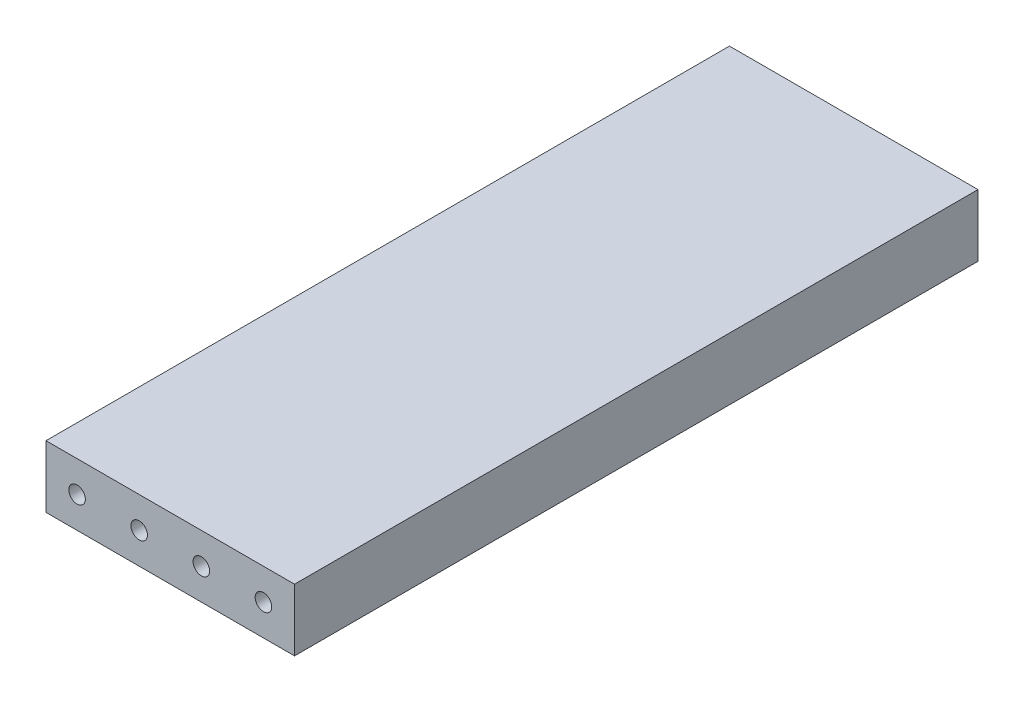
ISO-10303-21;
HEADER;
FILE_DESCRIPTION(('STEP AP214'),'2;1');
FILE_NAME('part.step','',(''),(''),'','','');
FILE_SCHEMA(('AUTOMOTIVE_DESIGN { 1 0 10303 214 1 1 1 1 }'));
ENDSEC;
DATA;
#1=APPLICATION_CONTEXT('core data for automotive mechanical design processes');
#2=APPLICATION_PROTOCOL_DEFINITION('international standard','automotive_design',2000,#1);
#3=PRODUCT_CONTEXT('',#1,'mechanical');
#4=PRODUCT('Part','Part','',(#3));
#5=PRODUCT_RELATED_PRODUCT_CATEGORY('part','',(#4));
#6=PRODUCT_DEFINITION_FORMATION('','',#4);
#7=PRODUCT_DEFINITION_CONTEXT('part definition',#1,'design');
#8=PRODUCT_DEFINITION('design','',#6,#7);
#9=PRODUCT_DEFINITION_SHAPE('','',#8);
#10=(LENGTH_UNIT() NAMED_UNIT(*) SI_UNIT(.MILLI.,.METRE.));
#11=(NAMED_UNIT(*) PLANE_ANGLE_UNIT() SI_UNIT($,.RADIAN.));
#12=(NAMED_UNIT(*) SI_UNIT($,.STERADIAN.) SOLID_ANGLE_UNIT());
#13=UNCERTAINTY_MEASURE_WITH_UNIT(LENGTH_MEASURE(1.E-05),#10,'distance_accuracy_value','');
#14=(GEOMETRIC_REPRESENTATION_CONTEXT(3) GLOBAL_UNCERTAINTY_ASSIGNED_CONTEXT((#13)) GLOBAL_UNIT_ASSIGNED_CONTEXT((#10,
#11,#12)) REPRESENTATION_CONTEXT('',''));
#15=CARTESIAN_POINT('',(0.,0.,0.));
#16=DIRECTION('',(0.,0.,1.));
#17=DIRECTION('',(1.,0.,0.));
#18=AXIS2_PLACEMENT_3D('',#15,#16,#17);
#19=CARTESIAN_POINT('',(60.,-15.,165.));
#20=DIRECTION('',(-1.,0.,0.));
#21=DIRECTION('',(0.,0.,1.));
#22=AXIS2_PLACEMENT_3D('',#19,#20,#21);
#23=PLANE('',#22);
#24=DIRECTION('',(0.,1.,0.));
#25=VECTOR('',#24,1.);
#26=CARTESIAN_POINT('',(60.,-15.,-165.));
#27=LINE('',#26,#25);
#28=CARTESIAN_POINT('',(60.,-15.,-165.));
#29=VERTEX_POINT('',#28);
#30=CARTESIAN_POINT('',(60.,15.,-165.));
#31=VERTEX_POINT('',#30);
#32=EDGE_CURVE('E98',#29,#31,#27,.T.);
#33=ORIENTED_EDGE('',*,*,#32,.T.);
#34=DIRECTION('',(0.,0.,-1.));
#35=VECTOR('',#34,1.);
#36=CARTESIAN_POINT('',(60.,15.,165.));
#37=LINE('',#36,#35);
#38=CARTESIAN_POINT('',(60.,15.,165.));
#39=VERTEX_POINT('',#38);
#40=EDGE_CURVE('E11',#39,#31,#37,.T.);
#41=ORIENTED_EDGE('',*,*,#40,.F.);
#42=DIRECTION('',(0.,1.,0.));
#43=VECTOR('',#42,1.);
#44=CARTESIAN_POINT('',(60.,-15.,165.));
#45=LINE('',#44,#43);
#46=CARTESIAN_POINT('',(60.,-15.,165.));
#47=VERTEX_POINT('',#46);
#48=EDGE_CURVE('E86',#47,#39,#45,.T.);
#49=ORIENTED_EDGE('',*,*,#48,.F.);
#50=DIRECTION('',(0.,0.,-1.));
#51=VECTOR('',#50,1.);
#52=CARTESIAN_POINT('',(60.,-15.,165.));
#53=LINE('',#52,#51);
#54=EDGE_CURVE('E94',#47,#29,#53,.T.);
#55=ORIENTED_EDGE('',*,*,#54,.T.);
#56=EDGE_LOOP('',(#33,#41,#49,#55));
#57=FACE_BOUND('',#56,.T.);
#58=ADVANCED_FACE('F35',(#57),#23,.F.);
#59=CARTESIAN_POINT('',(-60.,15.,165.));
#60=DIRECTION('',(0.,-1.,0.));
#61=DIRECTION('',(0.,0.,-1.));
#62=AXIS2_PLACEMENT_3D('',#59,#60,#61);
#63=PLANE('',#62);
#64=DIRECTION('',(-1.,0.,0.));
#65=VECTOR('',#64,1.);
#66=CARTESIAN_POINT('',(-60.,15.,-165.));
#67=LINE('',#66,#65);
#68=CARTESIAN_POINT('',(-60.,15.,-165.));
#69=VERTEX_POINT('',#68);
#70=EDGE_CURVE('E90',#31,#69,#67,.T.);
#71=ORIENTED_EDGE('',*,*,#70,.T.);
#72=DIRECTION('',(0.,0.,-1.));
#73=VECTOR('',#72,1.);
#74=CARTESIAN_POINT('',(-60.,15.,165.));
#75=LINE('',#74,#73);
#76=CARTESIAN_POINT('',(-60.,15.,165.));
#77=VERTEX_POINT('',#76);
#78=EDGE_CURVE('E43',#77,#69,#75,.T.);
#79=ORIENTED_EDGE('',*,*,#78,.F.);
#80=DIRECTION('',(-1.,0.,0.));
#81=VECTOR('',#80,1.);
#82=CARTESIAN_POINT('',(-60.,15.,165.));
#83=LINE('',#82,#81);
#84=EDGE_CURVE('E81',#39,#77,#83,.T.);
#85=ORIENTED_EDGE('',*,*,#84,.F.);
#86=ORIENTED_EDGE('',*,*,#40,.T.);
#87=EDGE_LOOP('',(#71,#79,#85,#86));
#88=FACE_BOUND('',#87,.T.);
#89=ADVANCED_FACE('F89',(#88),#63,.F.);
#90=CARTESIAN_POINT('',(-60.,-15.,165.));
#91=DIRECTION('',(1.,0.,0.));
#92=DIRECTION('',(0.,0.,-1.));
#93=AXIS2_PLACEMENT_3D('',#90,#91,#92);
#94=PLANE('',#93);
#95=DIRECTION('',(0.,-1.,0.));
#96=VECTOR('',#95,1.);
#97=CARTESIAN_POINT('',(-60.,-15.,-165.));
#98=LINE('',#97,#96);
#99=CARTESIAN_POINT('',(-60.,-15.,-165.));
#100=VERTEX_POINT('',#99);
#101=EDGE_CURVE('E68',#69,#100,#98,.T.);
#102=ORIENTED_EDGE('',*,*,#101,.T.);
#103=DIRECTION('',(0.,0.,-1.));
#104=VECTOR('',#103,1.);
#105=CARTESIAN_POINT('',(-60.,-15.,165.));
#106=LINE('',#105,#104);
#107=CARTESIAN_POINT('',(-60.,-15.,165.));
#108=VERTEX_POINT('',#107);
#109=EDGE_CURVE('E91',#108,#100,#106,.T.);
#110=ORIENTED_EDGE('',*,*,#109,.F.);
#111=DIRECTION('',(0.,-1.,0.));
#112=VECTOR('',#111,1.);
#113=CARTESIAN_POINT('',(-60.,-15.,165.));
#114=LINE('',#113,#112);
#115=EDGE_CURVE('E84',#77,#108,#114,.T.);
#116=ORIENTED_EDGE('',*,*,#115,.F.);
#117=ORIENTED_EDGE('',*,*,#78,.T.);
#118=EDGE_LOOP('',(#102,#110,#116,#117));
#119=FACE_BOUND('',#118,.T.);
#120=ADVANCED_FACE('F92',(#119),#94,.F.);
#121=CARTESIAN_POINT('',(-60.,-15.,165.));
#122=DIRECTION('',(0.,1.,0.));
#123=DIRECTION('',(0.,0.,1.));
#124=AXIS2_PLACEMENT_3D('',#121,#122,#123);
#125=PLANE('',#124);
#126=DIRECTION('',(1.,0.,0.));
#127=VECTOR('',#126,1.);
#128=CARTESIAN_POINT('',(-60.,-15.,-165.));
#129=LINE('',#128,#127);
#130=EDGE_CURVE('E74',#100,#29,#129,.T.);
#131=ORIENTED_EDGE('',*,*,#130,.T.);
#132=ORIENTED_EDGE('',*,*,#54,.F.);
#133=DIRECTION('',(1.,0.,0.));
#134=VECTOR('',#133,1.);
#135=CARTESIAN_POINT('',(-60.,-15.,165.));
#136=LINE('',#135,#134);
#137=EDGE_CURVE('E51',#108,#47,#136,.T.);
#138=ORIENTED_EDGE('',*,*,#137,.F.);
#139=ORIENTED_EDGE('',*,*,#109,.T.);
#140=EDGE_LOOP('',(#131,#132,#138,#139));
#141=FACE_BOUND('',#140,.T.);
#142=ADVANCED_FACE('F106',(#141),#125,.F.);
#143=CARTESIAN_POINT('',(0.,0.,165.));
#144=DIRECTION('',(0.,0.,-1.));
#145=DIRECTION('',(-1.,0.,0.));
#146=AXIS2_PLACEMENT_3D('',#143,#144,#145);
#147=PLANE('',#146);
#148=CARTESIAN_POINT('',(-45.,0.,165.));
#149=DIRECTION('',(0.,0.,-1.));
#150=DIRECTION('',(-1.,0.,0.));
#151=AXIS2_PLACEMENT_3D('',#148,#149,#150);
#152=CIRCLE('',#151,4.00000000000001);
#153=CARTESIAN_POINT('',(-49.,0.,165.));
#154=VERTEX_POINT('',#153);
#155=EDGE_CURVE('E127',#154,#154,#152,.T.);
#156=ORIENTED_EDGE('',*,*,#155,.T.);
#157=EDGE_LOOP('',(#156));
#158=FACE_BOUND('',#157,.T.);
#159=CARTESIAN_POINT('',(-15.,0.,165.));
#160=DIRECTION('',(0.,0.,-1.));
#161=DIRECTION('',(-1.,0.,0.));
#162=AXIS2_PLACEMENT_3D('',#159,#160,#161);
#163=CIRCLE('',#162,4.00000000000001);
#164=CARTESIAN_POINT('',(-19.,0.,165.));
#165=VERTEX_POINT('',#164);
#166=EDGE_CURVE('E121',#165,#165,#163,.T.);
#167=ORIENTED_EDGE('',*,*,#166,.T.);
#168=EDGE_LOOP('',(#167));
#169=FACE_BOUND('',#168,.T.);
#170=CARTESIAN_POINT('',(15.,0.,165.));
#171=DIRECTION('',(0.,0.,-1.));
#172=DIRECTION('',(-1.,0.,0.));
#173=AXIS2_PLACEMENT_3D('',#170,#171,#172);
#174=CIRCLE('',#173,4.);
#175=CARTESIAN_POINT('',(11.,0.,165.));
#176=VERTEX_POINT('',#175);
#177=EDGE_CURVE('E115',#176,#176,#174,.T.);
#178=ORIENTED_EDGE('',*,*,#177,.T.);
#179=EDGE_LOOP('',(#178));
#180=FACE_BOUND('',#179,.T.);
#181=CARTESIAN_POINT('',(45.,0.,165.));
#182=DIRECTION('',(0.,0.,-1.));
#183=DIRECTION('',(-1.,0.,0.));
#184=AXIS2_PLACEMENT_3D('',#181,#182,#183);
#185=CIRCLE('',#184,4.);
#186=CARTESIAN_POINT('',(41.,0.,165.));
#187=VERTEX_POINT('',#186);
#188=EDGE_CURVE('E101',#187,#187,#185,.T.);
#189=ORIENTED_EDGE('',*,*,#188,.T.);
#190=EDGE_LOOP('',(#189));
#191=FACE_BOUND('',#190,.T.);
#192=ORIENTED_EDGE('',*,*,#48,.T.);
#193=ORIENTED_EDGE('',*,*,#84,.T.);
#194=ORIENTED_EDGE('',*,*,#115,.T.);
#195=ORIENTED_EDGE('',*,*,#137,.T.);
#196=EDGE_LOOP('',(#192,#193,#194,#195));
#197=FACE_BOUND('',#196,.T.);
#198=ADVANCED_FACE('F82',(#158,#169,#180,#191,#197),#147,.F.);
#199=CARTESIAN_POINT('',(0.,0.,-165.));
#200=DIRECTION('',(0.,0.,-1.));
#201=DIRECTION('',(-1.,0.,0.));
#202=AXIS2_PLACEMENT_3D('',#199,#200,#201);
#203=PLANE('',#202);
#204=CARTESIAN_POINT('',(-45.,0.,-165.));
#205=DIRECTION('',(0.,0.,-1.));
#206=DIRECTION('',(-1.,0.,0.));
#207=AXIS2_PLACEMENT_3D('',#204,#205,#206);
#208=CIRCLE('',#207,4.00000000000001);
#209=CARTESIAN_POINT('',(-49.,0.,-165.));
#210=VERTEX_POINT('',#209);
#211=EDGE_CURVE('E130',#210,#210,#208,.T.);
#212=ORIENTED_EDGE('',*,*,#211,.F.);
#213=EDGE_LOOP('',(#212));
#214=FACE_BOUND('',#213,.T.);
#215=CARTESIAN_POINT('',(-15.,0.,-165.));
#216=DIRECTION('',(0.,0.,-1.));
#217=DIRECTION('',(-1.,0.,0.));
#218=AXIS2_PLACEMENT_3D('',#215,#216,#217);
#219=CIRCLE('',#218,4.00000000000001);
#220=CARTESIAN_POINT('',(-19.,0.,-165.));
#221=VERTEX_POINT('',#220);
#222=EDGE_CURVE('E124',#221,#221,#219,.T.);
#223=ORIENTED_EDGE('',*,*,#222,.F.);
#224=EDGE_LOOP('',(#223));
#225=FACE_BOUND('',#224,.T.);
#226=CARTESIAN_POINT('',(15.,0.,-165.));
#227=DIRECTION('',(0.,0.,-1.));
#228=DIRECTION('',(-1.,0.,0.));
#229=AXIS2_PLACEMENT_3D('',#226,#227,#228);
#230=CIRCLE('',#229,4.);
#231=CARTESIAN_POINT('',(11.,0.,-165.));
#232=VERTEX_POINT('',#231);
#233=EDGE_CURVE('E118',#232,#232,#230,.T.);
#234=ORIENTED_EDGE('',*,*,#233,.F.);
#235=EDGE_LOOP('',(#234));
#236=FACE_BOUND('',#235,.T.);
#237=CARTESIAN_POINT('',(45.,0.,-165.));
#238=DIRECTION('',(0.,0.,-1.));
#239=DIRECTION('',(-1.,0.,0.));
#240=AXIS2_PLACEMENT_3D('',#237,#238,#239);
#241=CIRCLE('',#240,4.);
#242=CARTESIAN_POINT('',(41.,0.,-165.));
#243=VERTEX_POINT('',#242);
#244=EDGE_CURVE('E112',#243,#243,#241,.T.);
#245=ORIENTED_EDGE('',*,*,#244,.F.);
#246=EDGE_LOOP('',(#245));
#247=FACE_BOUND('',#246,.T.);
#248=ORIENTED_EDGE('',*,*,#32,.F.);
#249=ORIENTED_EDGE('',*,*,#130,.F.);
#250=ORIENTED_EDGE('',*,*,#101,.F.);
#251=ORIENTED_EDGE('',*,*,#70,.F.);
#252=EDGE_LOOP('',(#248,#249,#250,#251));
#253=FACE_BOUND('',#252,.T.);
#254=ADVANCED_FACE('F109',(#214,#225,#236,#247,#253),#203,.T.);
#255=CARTESIAN_POINT('',(45.,0.,165.));
#256=DIRECTION('',(0.,0.,-1.));
#257=DIRECTION('',(-1.,0.,0.));
#258=AXIS2_PLACEMENT_3D('',#255,#256,#257);
#259=CYLINDRICAL_SURFACE('',#258,4.);
#260=ORIENTED_EDGE('',*,*,#188,.F.);
#261=EDGE_LOOP('',(#260));
#262=FACE_BOUND('',#261,.T.);
#263=ORIENTED_EDGE('',*,*,#244,.T.);
#264=EDGE_LOOP('',(#263));
#265=FACE_BOUND('',#264,.T.);
#266=ADVANCED_FACE('F147',(#262,#265),#259,.F.);
#267=CARTESIAN_POINT('',(15.,0.,165.));
#268=DIRECTION('',(0.,0.,-1.));
#269=DIRECTION('',(-1.,0.,0.));
#270=AXIS2_PLACEMENT_3D('',#267,#268,#269);
#271=CYLINDRICAL_SURFACE('',#270,4.);
#272=ORIENTED_EDGE('',*,*,#177,.F.);
#273=EDGE_LOOP('',(#272));
#274=FACE_BOUND('',#273,.T.);
#275=ORIENTED_EDGE('',*,*,#233,.T.);
#276=EDGE_LOOP('',(#275));
#277=FACE_BOUND('',#276,.T.);
#278=ADVANCED_FACE('F156',(#274,#277),#271,.F.);
#279=CARTESIAN_POINT('',(-15.,0.,165.));
#280=DIRECTION('',(0.,0.,-1.));
#281=DIRECTION('',(-1.,0.,0.));
#282=AXIS2_PLACEMENT_3D('',#279,#280,#281);
#283=CYLINDRICAL_SURFACE('',#282,4.00000000000001);
#284=ORIENTED_EDGE('',*,*,#166,.F.);
#285=EDGE_LOOP('',(#284));
#286=FACE_BOUND('',#285,.T.);
#287=ORIENTED_EDGE('',*,*,#222,.T.);
#288=EDGE_LOOP('',(#287));
#289=FACE_BOUND('',#288,.T.);
#290=ADVANCED_FACE('F141',(#286,#289),#283,.F.);
#291=CARTESIAN_POINT('',(-45.,0.,165.));
#292=DIRECTION('',(0.,0.,-1.));
#293=DIRECTION('',(-1.,0.,0.));
#294=AXIS2_PLACEMENT_3D('',#291,#292,#293);
#295=CYLINDRICAL_SURFACE('',#294,4.00000000000001);
#296=ORIENTED_EDGE('',*,*,#155,.F.);
#297=EDGE_LOOP('',(#296));
#298=FACE_BOUND('',#297,.T.);
#299=ORIENTED_EDGE('',*,*,#211,.T.);
#300=EDGE_LOOP('',(#299));
#301=FACE_BOUND('',#300,.T.);
#302=ADVANCED_FACE('F138',(#298,#301),#295,.F.);
#303=CLOSED_SHELL('',(#58,#89,#120,#142,#198,#254,#266,#278,#290,#302));
#304=MANIFOLD_SOLID_BREP('B2',#303);
#305=ADVANCED_BREP_SHAPE_REPRESENTATION('',(#18,#304),#14);
#306=SHAPE_DEFINITION_REPRESENTATION(#9,#305);
ENDSEC;
END-ISO-10303-21;
